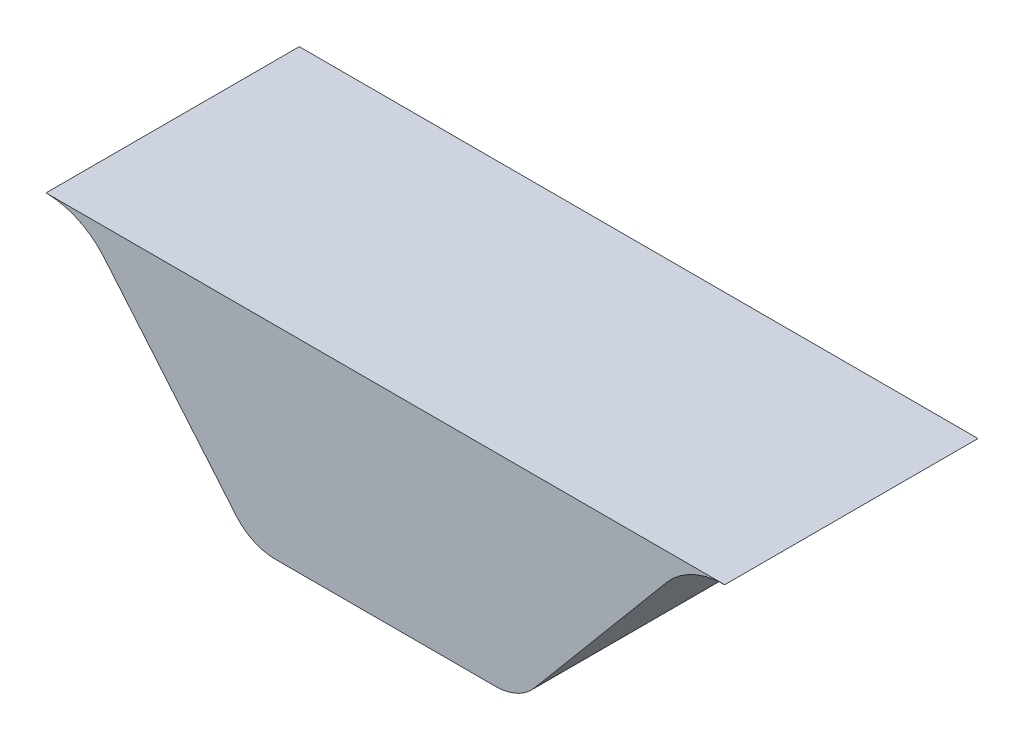
ISO-10303-21;
HEADER;
FILE_DESCRIPTION(('STEP AP214'),'2;1');
FILE_NAME('part.step','',(''),(''),'','','');
FILE_SCHEMA(('AUTOMOTIVE_DESIGN { 1 0 10303 214 1 1 1 1 }'));
ENDSEC;
DATA;
#1=APPLICATION_CONTEXT('core data for automotive mechanical design processes');
#2=APPLICATION_PROTOCOL_DEFINITION('international standard','automotive_design',2000,#1);
#3=PRODUCT_CONTEXT('',#1,'mechanical');
#4=PRODUCT('Part','Part','',(#3));
#5=PRODUCT_RELATED_PRODUCT_CATEGORY('part','',(#4));
#6=PRODUCT_DEFINITION_FORMATION('','',#4);
#7=PRODUCT_DEFINITION_CONTEXT('part definition',#1,'design');
#8=PRODUCT_DEFINITION('design','',#6,#7);
#9=PRODUCT_DEFINITION_SHAPE('','',#8);
#10=(LENGTH_UNIT() NAMED_UNIT(*) SI_UNIT(.MILLI.,.METRE.));
#11=(NAMED_UNIT(*) PLANE_ANGLE_UNIT() SI_UNIT($,.RADIAN.));
#12=(NAMED_UNIT(*) SI_UNIT($,.STERADIAN.) SOLID_ANGLE_UNIT());
#13=UNCERTAINTY_MEASURE_WITH_UNIT(LENGTH_MEASURE(1.E-05),#10,'distance_accuracy_value','');
#14=(GEOMETRIC_REPRESENTATION_CONTEXT(3) GLOBAL_UNCERTAINTY_ASSIGNED_CONTEXT((#13)) GLOBAL_UNIT_ASSIGNED_CONTEXT((#10,
#11,#12)) REPRESENTATION_CONTEXT('',''));
#15=CARTESIAN_POINT('',(0.,0.,0.));
#16=DIRECTION('',(0.,0.,1.));
#17=DIRECTION('',(1.,0.,0.));
#18=AXIS2_PLACEMENT_3D('',#15,#16,#17);
#19=CARTESIAN_POINT('',(2.64360147529085,-4.,2.5));
#20=DIRECTION('',(0.,1.,0.));
#21=DIRECTION('',(0.,0.,1.));
#22=AXIS2_PLACEMENT_3D('',#19,#20,#21);
#23=PLANE('',#22);
#24=DIRECTION('',(1.,0.,0.));
#25=VECTOR('',#24,1.);
#26=CARTESIAN_POINT('',(2.64360147529085,-4.,2.5));
#27=LINE('',#26,#25);
#28=CARTESIAN_POINT('',(-2.17729381713585,-4.,2.5));
#29=VERTEX_POINT('',#28);
#30=CARTESIAN_POINT('',(2.17729381713585,-4.,2.5));
#31=VERTEX_POINT('',#30);
#32=EDGE_CURVE('E170',#29,#31,#27,.T.);
#33=ORIENTED_EDGE('',*,*,#32,.F.);
#34=DIRECTION('',(0.,0.,-1.));
#35=VECTOR('',#34,1.);
#36=CARTESIAN_POINT('',(-2.17729381713585,-4.,2.5));
#37=LINE('',#36,#35);
#38=CARTESIAN_POINT('',(-2.17729381713585,-4.,-2.5));
#39=VERTEX_POINT('',#38);
#40=EDGE_CURVE('E148',#29,#39,#37,.T.);
#41=ORIENTED_EDGE('',*,*,#40,.T.);
#42=DIRECTION('',(1.,0.,0.));
#43=VECTOR('',#42,1.);
#44=CARTESIAN_POINT('',(2.64360147529085,-4.,-2.5));
#45=LINE('',#44,#43);
#46=CARTESIAN_POINT('',(2.17729381713585,-4.,-2.5));
#47=VERTEX_POINT('',#46);
#48=EDGE_CURVE('E163',#39,#47,#45,.T.);
#49=ORIENTED_EDGE('',*,*,#48,.T.);
#50=DIRECTION('',(0.,0.,-1.));
#51=VECTOR('',#50,1.);
#52=CARTESIAN_POINT('',(2.17729381713585,-4.,2.5));
#53=LINE('',#52,#51);
#54=EDGE_CURVE('E153',#47,#31,#53,.F.);
#55=ORIENTED_EDGE('',*,*,#54,.T.);
#56=EDGE_LOOP('',(#33,#41,#49,#55));
#57=FACE_BOUND('',#56,.T.);
#58=CARTESIAN_POINT('',(0.,-4.,0.));
#59=DIRECTION('',(0.,1.,0.));
#60=DIRECTION('',(0.,0.,1.));
#61=AXIS2_PLACEMENT_3D('',#58,#59,#60);
#62=CIRCLE('',#61,1.5);
#63=CARTESIAN_POINT('',(0.,-4.,1.5));
#64=VERTEX_POINT('',#63);
#65=EDGE_CURVE('E12',#64,#64,#62,.F.);
#66=ORIENTED_EDGE('',*,*,#65,.F.);
#67=EDGE_LOOP('',(#66));
#68=FACE_BOUND('',#67,.T.);
#69=ADVANCED_FACE('F43',(#57,#68),#23,.F.);
#70=CARTESIAN_POINT('',(-2.64360147529084,-4.,2.5));
#71=DIRECTION('',(0.766044443118974,0.642787609686544,0.));
#72=DIRECTION('',(-0.642787609686544,0.766044443118974,0.));
#73=AXIS2_PLACEMENT_3D('',#70,#71,#72);
#74=PLANE('',#73);
#75=DIRECTION('',(0.642787609686544,-0.766044443118974,0.));
#76=VECTOR('',#75,1.);
#77=CARTESIAN_POINT('',(-2.64360147529084,-4.,2.5));
#78=LINE('',#77,#76);
#79=CARTESIAN_POINT('',(-5.55039482255403,-0.535818585470184,2.5));
#80=VERTEX_POINT('',#79);
#81=CARTESIAN_POINT('',(-2.94333826025482,-3.64278760968654,2.5));
#82=VERTEX_POINT('',#81);
#83=EDGE_CURVE('E128',#80,#82,#78,.T.);
#84=ORIENTED_EDGE('',*,*,#83,.F.);
#85=DIRECTION('',(0.,0.,-1.));
#86=VECTOR('',#85,1.);
#87=CARTESIAN_POINT('',(-5.55039482255403,-0.535818585470184,-2.5));
#88=LINE('',#87,#86);
#89=CARTESIAN_POINT('',(-5.55039482255403,-0.535818585470184,-2.5));
#90=VERTEX_POINT('',#89);
#91=EDGE_CURVE('E121',#80,#90,#88,.T.);
#92=ORIENTED_EDGE('',*,*,#91,.T.);
#93=DIRECTION('',(0.642787609686544,-0.766044443118974,0.));
#94=VECTOR('',#93,1.);
#95=CARTESIAN_POINT('',(-2.64360147529084,-4.,-2.5));
#96=LINE('',#95,#94);
#97=CARTESIAN_POINT('',(-2.94333826025482,-3.64278760968654,-2.5));
#98=VERTEX_POINT('',#97);
#99=EDGE_CURVE('E165',#90,#98,#96,.T.);
#100=ORIENTED_EDGE('',*,*,#99,.T.);
#101=DIRECTION('',(0.,0.,-1.));
#102=VECTOR('',#101,1.);
#103=CARTESIAN_POINT('',(-2.94333826025482,-3.64278760968654,2.5));
#104=LINE('',#103,#102);
#105=EDGE_CURVE('E142',#98,#82,#104,.F.);
#106=ORIENTED_EDGE('',*,*,#105,.T.);
#107=EDGE_LOOP('',(#84,#92,#100,#106));
#108=FACE_BOUND('',#107,.T.);
#109=ADVANCED_FACE('F181',(#108),#74,.F.);
#110=ORIENTED_EDGE('',*,*,#65,.T.);
#111=EDGE_LOOP('',(#110));
#112=FACE_BOUND('',#111,.T.);
#113=ADVANCED_FACE('F194',(#112),#23,.F.);
#114=CARTESIAN_POINT('',(6.,0.,2.5));
#115=DIRECTION('',(-0.766044443118975,0.642787609686543,0.));
#116=DIRECTION('',(-0.642787609686543,-0.766044443118975,0.));
#117=AXIS2_PLACEMENT_3D('',#114,#115,#116);
#118=PLANE('',#117);
#119=DIRECTION('',(0.642787609686543,0.766044443118975,0.));
#120=VECTOR('',#119,1.);
#121=CARTESIAN_POINT('',(6.,0.,-2.5));
#122=LINE('',#121,#120);
#123=CARTESIAN_POINT('',(2.94333826025482,-3.64278760968654,-2.5));
#124=VERTEX_POINT('',#123);
#125=CARTESIAN_POINT('',(5.55039482255403,-0.535818585470184,-2.5));
#126=VERTEX_POINT('',#125);
#127=EDGE_CURVE('E129',#124,#126,#122,.T.);
#128=ORIENTED_EDGE('',*,*,#127,.T.);
#129=DIRECTION('',(0.,0.,-1.));
#130=VECTOR('',#129,1.);
#131=CARTESIAN_POINT('',(5.55039482255403,-0.535818585470184,2.5));
#132=LINE('',#131,#130);
#133=CARTESIAN_POINT('',(5.55039482255403,-0.535818585470184,2.5));
#134=VERTEX_POINT('',#133);
#135=EDGE_CURVE('E66',#126,#134,#132,.F.);
#136=ORIENTED_EDGE('',*,*,#135,.T.);
#137=DIRECTION('',(0.642787609686543,0.766044443118975,0.));
#138=VECTOR('',#137,1.);
#139=CARTESIAN_POINT('',(6.,0.,2.5));
#140=LINE('',#139,#138);
#141=CARTESIAN_POINT('',(2.94333826025482,-3.64278760968654,2.5));
#142=VERTEX_POINT('',#141);
#143=EDGE_CURVE('E168',#142,#134,#140,.T.);
#144=ORIENTED_EDGE('',*,*,#143,.F.);
#145=DIRECTION('',(0.,0.,-1.));
#146=VECTOR('',#145,1.);
#147=CARTESIAN_POINT('',(2.94333826025482,-3.64278760968654,2.5));
#148=LINE('',#147,#146);
#149=EDGE_CURVE('E159',#142,#124,#148,.T.);
#150=ORIENTED_EDGE('',*,*,#149,.T.);
#151=EDGE_LOOP('',(#128,#136,#144,#150));
#152=FACE_BOUND('',#151,.T.);
#153=ADVANCED_FACE('F192',(#152),#118,.F.);
#154=CARTESIAN_POINT('',(0.,0.,2.5));
#155=DIRECTION('',(0.,0.,1.));
#156=DIRECTION('',(1.,0.,0.));
#157=AXIS2_PLACEMENT_3D('',#154,#155,#156);
#158=PLANE('',#157);
#159=DIRECTION('',(-1.,0.,0.));
#160=VECTOR('',#159,1.);
#161=CARTESIAN_POINT('',(-6.,0.,2.5));
#162=LINE('',#161,#160);
#163=CARTESIAN_POINT('',(6.69946148723249,0.,2.5));
#164=VERTEX_POINT('',#163);
#165=CARTESIAN_POINT('',(-6.69946148723249,0.,2.5));
#166=VERTEX_POINT('',#165);
#167=EDGE_CURVE('E116',#164,#166,#162,.T.);
#168=ORIENTED_EDGE('',*,*,#167,.T.);
#169=CARTESIAN_POINT('',(-6.69946148723249,-1.5,2.5));
#170=DIRECTION('',(0.,0.,1.));
#171=DIRECTION('',(1.,0.,0.));
#172=AXIS2_PLACEMENT_3D('',#169,#170,#171);
#173=CIRCLE('',#172,1.5);
#174=EDGE_CURVE('E131',#166,#80,#173,.F.);
#175=ORIENTED_EDGE('',*,*,#174,.T.);
#176=ORIENTED_EDGE('',*,*,#83,.T.);
#177=CARTESIAN_POINT('',(-2.17729381713585,-3.,2.5));
#178=DIRECTION('',(0.,0.,1.));
#179=DIRECTION('',(1.,0.,0.));
#180=AXIS2_PLACEMENT_3D('',#177,#178,#179);
#181=CIRCLE('',#180,1.);
#182=EDGE_CURVE('E140',#82,#29,#181,.T.);
#183=ORIENTED_EDGE('',*,*,#182,.T.);
#184=ORIENTED_EDGE('',*,*,#32,.T.);
#185=CARTESIAN_POINT('',(2.17729381713585,-3.,2.5));
#186=DIRECTION('',(0.,0.,1.));
#187=DIRECTION('',(1.,0.,0.));
#188=AXIS2_PLACEMENT_3D('',#185,#186,#187);
#189=CIRCLE('',#188,1.);
#190=EDGE_CURVE('E151',#31,#142,#189,.T.);
#191=ORIENTED_EDGE('',*,*,#190,.T.);
#192=ORIENTED_EDGE('',*,*,#143,.T.);
#193=CARTESIAN_POINT('',(6.69946148723249,-1.5,2.5));
#194=DIRECTION('',(0.,0.,1.));
#195=DIRECTION('',(1.,0.,0.));
#196=AXIS2_PLACEMENT_3D('',#193,#194,#195);
#197=CIRCLE('',#196,1.5);
#198=EDGE_CURVE('E52',#134,#164,#197,.F.);
#199=ORIENTED_EDGE('',*,*,#198,.T.);
#200=EDGE_LOOP('',(#168,#175,#176,#183,#184,#191,#192,#199));
#201=FACE_BOUND('',#200,.T.);
#202=ADVANCED_FACE('F174',(#201),#158,.T.);
#203=CARTESIAN_POINT('',(0.,0.,-2.5));
#204=DIRECTION('',(0.,0.,1.));
#205=DIRECTION('',(1.,0.,0.));
#206=AXIS2_PLACEMENT_3D('',#203,#204,#205);
#207=PLANE('',#206);
#208=ORIENTED_EDGE('',*,*,#48,.F.);
#209=CARTESIAN_POINT('',(-2.17729381713585,-3.,-2.5));
#210=DIRECTION('',(0.,0.,1.));
#211=DIRECTION('',(1.,0.,0.));
#212=AXIS2_PLACEMENT_3D('',#209,#210,#211);
#213=CIRCLE('',#212,1.);
#214=EDGE_CURVE('E145',#39,#98,#213,.F.);
#215=ORIENTED_EDGE('',*,*,#214,.T.);
#216=ORIENTED_EDGE('',*,*,#99,.F.);
#217=CARTESIAN_POINT('',(-6.69946148723249,-1.5,-2.5));
#218=DIRECTION('',(0.,0.,1.));
#219=DIRECTION('',(1.,0.,0.));
#220=AXIS2_PLACEMENT_3D('',#217,#218,#219);
#221=CIRCLE('',#220,1.5);
#222=CARTESIAN_POINT('',(-6.69946148723249,0.,-2.5));
#223=VERTEX_POINT('',#222);
#224=EDGE_CURVE('E126',#90,#223,#221,.T.);
#225=ORIENTED_EDGE('',*,*,#224,.T.);
#226=DIRECTION('',(-1.,0.,0.));
#227=VECTOR('',#226,1.);
#228=CARTESIAN_POINT('',(-6.,0.,-2.5));
#229=LINE('',#228,#227);
#230=CARTESIAN_POINT('',(6.69946148723249,0.,-2.5));
#231=VERTEX_POINT('',#230);
#232=EDGE_CURVE('E113',#231,#223,#229,.T.);
#233=ORIENTED_EDGE('',*,*,#232,.F.);
#234=CARTESIAN_POINT('',(6.69946148723249,-1.5,-2.5));
#235=DIRECTION('',(0.,0.,1.));
#236=DIRECTION('',(1.,0.,0.));
#237=AXIS2_PLACEMENT_3D('',#234,#235,#236);
#238=CIRCLE('',#237,1.5);
#239=EDGE_CURVE('E59',#231,#126,#238,.T.);
#240=ORIENTED_EDGE('',*,*,#239,.T.);
#241=ORIENTED_EDGE('',*,*,#127,.F.);
#242=CARTESIAN_POINT('',(2.17729381713585,-3.,-2.5));
#243=DIRECTION('',(0.,0.,1.));
#244=DIRECTION('',(1.,0.,0.));
#245=AXIS2_PLACEMENT_3D('',#242,#243,#244);
#246=CIRCLE('',#245,1.);
#247=EDGE_CURVE('E156',#124,#47,#246,.F.);
#248=ORIENTED_EDGE('',*,*,#247,.T.);
#249=EDGE_LOOP('',(#208,#215,#216,#225,#233,#240,#241,#248));
#250=FACE_BOUND('',#249,.T.);
#251=ADVANCED_FACE('F124',(#250),#207,.F.);
#252=CARTESIAN_POINT('',(2.17729381713585,-3.,2.5));
#253=DIRECTION('',(0.,0.,-1.));
#254=DIRECTION('',(-1.,0.,0.));
#255=AXIS2_PLACEMENT_3D('',#252,#253,#254);
#256=CYLINDRICAL_SURFACE('',#255,1.);
#257=ORIENTED_EDGE('',*,*,#190,.F.);
#258=ORIENTED_EDGE('',*,*,#54,.F.);
#259=ORIENTED_EDGE('',*,*,#247,.F.);
#260=ORIENTED_EDGE('',*,*,#149,.F.);
#261=EDGE_LOOP('',(#257,#258,#259,#260));
#262=FACE_BOUND('',#261,.T.);
#263=ADVANCED_FACE('F191',(#262),#256,.T.);
#264=CARTESIAN_POINT('',(-2.17729381713585,-3.,2.5));
#265=DIRECTION('',(0.,0.,-1.));
#266=DIRECTION('',(-1.,0.,0.));
#267=AXIS2_PLACEMENT_3D('',#264,#265,#266);
#268=CYLINDRICAL_SURFACE('',#267,1.);
#269=ORIENTED_EDGE('',*,*,#182,.F.);
#270=ORIENTED_EDGE('',*,*,#105,.F.);
#271=ORIENTED_EDGE('',*,*,#214,.F.);
#272=ORIENTED_EDGE('',*,*,#40,.F.);
#273=EDGE_LOOP('',(#269,#270,#271,#272));
#274=FACE_BOUND('',#273,.T.);
#275=ADVANCED_FACE('F184',(#274),#268,.T.);
#276=CARTESIAN_POINT('',(-6.69946148723249,-1.5,2.5));
#277=DIRECTION('',(0.,0.,1.));
#278=DIRECTION('',(1.,0.,0.));
#279=AXIS2_PLACEMENT_3D('',#276,#277,#278);
#280=CYLINDRICAL_SURFACE('',#279,1.5);
#281=ORIENTED_EDGE('',*,*,#174,.F.);
#282=DIRECTION('',(0.,0.,-1.));
#283=VECTOR('',#282,1.);
#284=CARTESIAN_POINT('',(-6.69946148723249,0.,2.5));
#285=LINE('',#284,#283);
#286=EDGE_CURVE('E120',#223,#166,#285,.F.);
#287=ORIENTED_EDGE('',*,*,#286,.F.);
#288=ORIENTED_EDGE('',*,*,#224,.F.);
#289=ORIENTED_EDGE('',*,*,#91,.F.);
#290=EDGE_LOOP('',(#281,#287,#288,#289));
#291=FACE_BOUND('',#290,.T.);
#292=ADVANCED_FACE('F213',(#291),#280,.F.);
#293=CARTESIAN_POINT('',(6.69946148723249,-1.5,25.));
#294=DIRECTION('',(0.,0.,1.));
#295=DIRECTION('',(1.,0.,0.));
#296=AXIS2_PLACEMENT_3D('',#293,#294,#295);
#297=CYLINDRICAL_SURFACE('',#296,1.5);
#298=ORIENTED_EDGE('',*,*,#198,.F.);
#299=ORIENTED_EDGE('',*,*,#135,.F.);
#300=ORIENTED_EDGE('',*,*,#239,.F.);
#301=DIRECTION('',(0.,0.,-1.));
#302=VECTOR('',#301,1.);
#303=CARTESIAN_POINT('',(6.69946148723249,0.,-2.5));
#304=LINE('',#303,#302);
#305=EDGE_CURVE('E111',#164,#231,#304,.T.);
#306=ORIENTED_EDGE('',*,*,#305,.F.);
#307=EDGE_LOOP('',(#298,#299,#300,#306));
#308=FACE_BOUND('',#307,.T.);
#309=ADVANCED_FACE('F45',(#308),#297,.F.);
#310=CARTESIAN_POINT('',(25.,0.,25.));
#311=DIRECTION('',(0.,-1.,0.));
#312=DIRECTION('',(0.,0.,-1.));
#313=AXIS2_PLACEMENT_3D('',#310,#311,#312);
#314=PLANE('',#313);
#315=ORIENTED_EDGE('',*,*,#167,.F.);
#316=ORIENTED_EDGE('',*,*,#305,.T.);
#317=ORIENTED_EDGE('',*,*,#232,.T.);
#318=ORIENTED_EDGE('',*,*,#286,.T.);
#319=EDGE_LOOP('',(#315,#316,#317,#318));
#320=FACE_BOUND('',#319,.T.);
#321=ADVANCED_FACE('F112',(#320),#314,.F.);
#322=CLOSED_SHELL('',(#69,#109,#113,#153,#202,#251,#263,#275,#292,#309,#321));
#323=MANIFOLD_SOLID_BREP('B2',#322);
#324=ADVANCED_BREP_SHAPE_REPRESENTATION('',(#18,#323),#14);
#325=SHAPE_DEFINITION_REPRESENTATION(#9,#324);
ENDSEC;
END-ISO-10303-21;
